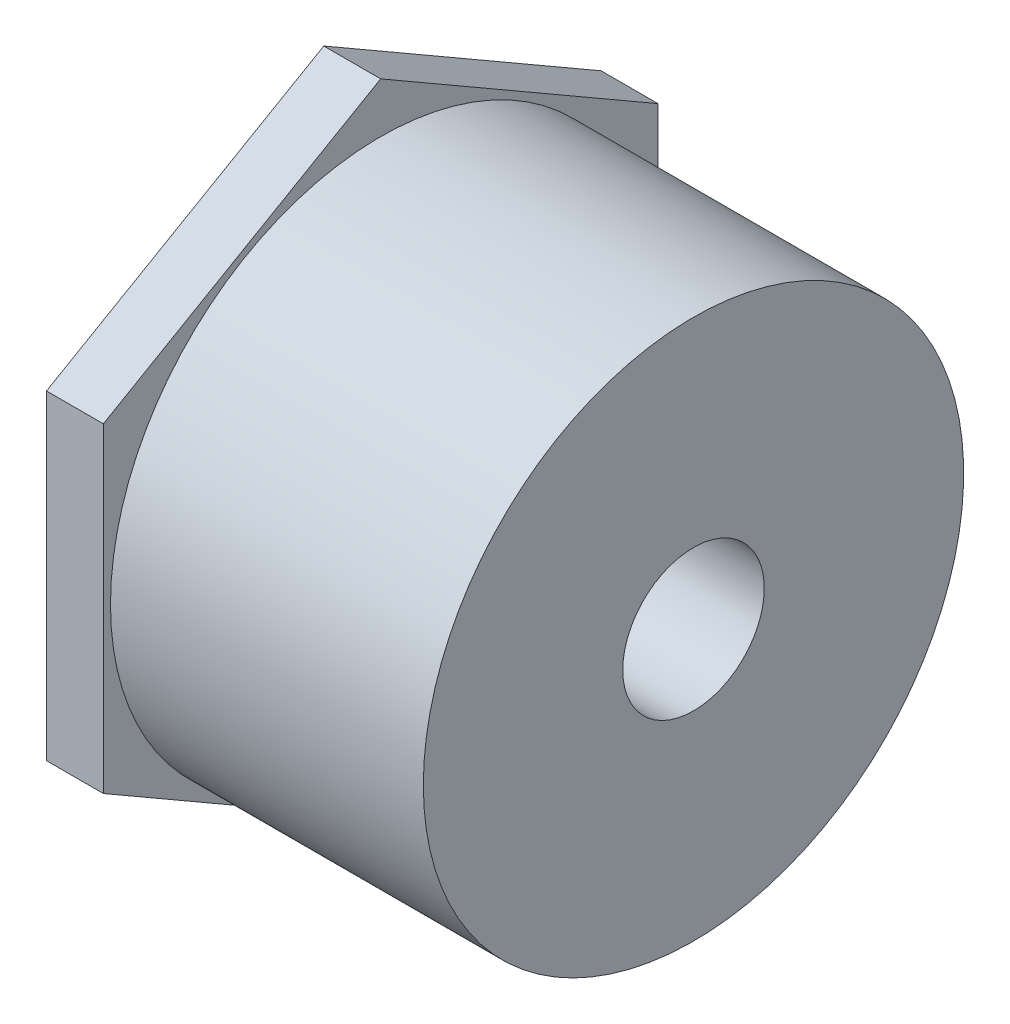
ISO-10303-21;
HEADER;
FILE_DESCRIPTION(('STEP AP214'),'2;1');
FILE_NAME('part.step','',(''),(''),'','','');
FILE_SCHEMA(('AUTOMOTIVE_DESIGN { 1 0 10303 214 1 1 1 1 }'));
ENDSEC;
DATA;
#1=APPLICATION_CONTEXT('core data for automotive mechanical design processes');
#2=APPLICATION_PROTOCOL_DEFINITION('international standard','automotive_design',2000,#1);
#3=PRODUCT_CONTEXT('',#1,'mechanical');
#4=PRODUCT('Part','Part','',(#3));
#5=PRODUCT_RELATED_PRODUCT_CATEGORY('part','',(#4));
#6=PRODUCT_DEFINITION_FORMATION('','',#4);
#7=PRODUCT_DEFINITION_CONTEXT('part definition',#1,'design');
#8=PRODUCT_DEFINITION('design','',#6,#7);
#9=PRODUCT_DEFINITION_SHAPE('','',#8);
#10=(LENGTH_UNIT() NAMED_UNIT(*) SI_UNIT(.MILLI.,.METRE.));
#11=(NAMED_UNIT(*) PLANE_ANGLE_UNIT() SI_UNIT($,.RADIAN.));
#12=(NAMED_UNIT(*) SI_UNIT($,.STERADIAN.) SOLID_ANGLE_UNIT());
#13=UNCERTAINTY_MEASURE_WITH_UNIT(LENGTH_MEASURE(1.E-05),#10,'distance_accuracy_value','');
#14=(GEOMETRIC_REPRESENTATION_CONTEXT(3) GLOBAL_UNCERTAINTY_ASSIGNED_CONTEXT((#13)) GLOBAL_UNIT_ASSIGNED_CONTEXT((#10,
#11,#12)) REPRESENTATION_CONTEXT('',''));
#15=CARTESIAN_POINT('',(0.,0.,0.));
#16=DIRECTION('',(0.,0.,1.));
#17=DIRECTION('',(1.,0.,0.));
#18=AXIS2_PLACEMENT_3D('',#15,#16,#17);
#19=CARTESIAN_POINT('',(-41.275,0.,0.));
#20=DIRECTION('',(-1.,0.,0.));
#21=DIRECTION('',(0.,0.,1.));
#22=AXIS2_PLACEMENT_3D('',#19,#20,#21);
#23=CYLINDRICAL_SURFACE('',#22,30.1625);
#24=CARTESIAN_POINT('',(0.,0.,0.));
#25=DIRECTION('',(-1.,0.,0.));
#26=DIRECTION('',(0.,0.,1.));
#27=AXIS2_PLACEMENT_3D('',#24,#25,#26);
#28=CIRCLE('',#27,30.1625);
#29=CARTESIAN_POINT('',(0.,0.,30.1625));
#30=VERTEX_POINT('',#29);
#31=EDGE_CURVE('E143',#30,#30,#28,.T.);
#32=ORIENTED_EDGE('',*,*,#31,.T.);
#33=EDGE_LOOP('',(#32));
#34=FACE_BOUND('',#33,.T.);
#35=CARTESIAN_POINT('',(-34.925,0.,0.));
#36=DIRECTION('',(-1.,0.,0.));
#37=DIRECTION('',(0.,0.,1.));
#38=AXIS2_PLACEMENT_3D('',#35,#36,#37);
#39=CIRCLE('',#38,30.1625);
#40=CARTESIAN_POINT('',(-34.925,0.,30.1625));
#41=VERTEX_POINT('',#40);
#42=EDGE_CURVE('E36',#41,#41,#39,.F.);
#43=ORIENTED_EDGE('',*,*,#42,.T.);
#44=EDGE_LOOP('',(#43));
#45=FACE_BOUND('',#44,.T.);
#46=ADVANCED_FACE('F32',(#34,#45),#23,.T.);
#47=CARTESIAN_POINT('',(-41.275,-30.1625,0.));
#48=DIRECTION('',(-1.,0.,0.));
#49=DIRECTION('',(0.,0.,1.));
#50=AXIS2_PLACEMENT_3D('',#47,#48,#49);
#51=PLANE('',#50);
#52=CARTESIAN_POINT('',(-41.275,0.,0.));
#53=DIRECTION('',(-1.,0.,0.));
#54=DIRECTION('',(0.,0.,1.));
#55=AXIS2_PLACEMENT_3D('',#52,#53,#54);
#56=CIRCLE('',#55,10.7696);
#57=CARTESIAN_POINT('',(-41.275,0.,10.7696));
#58=VERTEX_POINT('',#57);
#59=EDGE_CURVE('E11',#58,#58,#56,.T.);
#60=ORIENTED_EDGE('',*,*,#59,.F.);
#61=EDGE_LOOP('',(#60));
#62=FACE_BOUND('',#61,.T.);
#63=DIRECTION('',(0.,0.5,-0.866025403784439));
#64=VECTOR('',#63,1.);
#65=CARTESIAN_POINT('',(-41.275,17.8725992706014,30.95625));
#66=LINE('',#65,#64);
#67=CARTESIAN_POINT('',(-41.275,17.8725992706014,30.95625));
#68=VERTEX_POINT('',#67);
#69=CARTESIAN_POINT('',(-41.275,35.7451985412027,0.));
#70=VERTEX_POINT('',#69);
#71=EDGE_CURVE('E121',#68,#70,#66,.T.);
#72=ORIENTED_EDGE('',*,*,#71,.T.);
#73=DIRECTION('',(0.,-0.5,-0.866025403784439));
#74=VECTOR('',#73,1.);
#75=CARTESIAN_POINT('',(-41.275,35.7451985412027,0.));
#76=LINE('',#75,#74);
#77=CARTESIAN_POINT('',(-41.275,17.8725992706014,-30.95625));
#78=VERTEX_POINT('',#77);
#79=EDGE_CURVE('E124',#70,#78,#76,.T.);
#80=ORIENTED_EDGE('',*,*,#79,.T.);
#81=DIRECTION('',(0.,-1.,0.));
#82=VECTOR('',#81,1.);
#83=CARTESIAN_POINT('',(-41.275,17.8725992706014,-30.95625));
#84=LINE('',#83,#82);
#85=CARTESIAN_POINT('',(-41.275,-17.8725992706013,-30.95625));
#86=VERTEX_POINT('',#85);
#87=EDGE_CURVE('E127',#78,#86,#84,.T.);
#88=ORIENTED_EDGE('',*,*,#87,.T.);
#89=DIRECTION('',(0.,-0.5,0.866025403784439));
#90=VECTOR('',#89,1.);
#91=CARTESIAN_POINT('',(-41.275,-17.8725992706013,-30.95625));
#92=LINE('',#91,#90);
#93=CARTESIAN_POINT('',(-41.275,-35.7451985412027,0.));
#94=VERTEX_POINT('',#93);
#95=EDGE_CURVE('E130',#86,#94,#92,.T.);
#96=ORIENTED_EDGE('',*,*,#95,.T.);
#97=DIRECTION('',(0.,0.5,0.866025403784439));
#98=VECTOR('',#97,1.);
#99=CARTESIAN_POINT('',(-41.275,-35.7451985412027,0.));
#100=LINE('',#99,#98);
#101=CARTESIAN_POINT('',(-41.275,-17.8725992706014,30.95625));
#102=VERTEX_POINT('',#101);
#103=EDGE_CURVE('E98',#94,#102,#100,.T.);
#104=ORIENTED_EDGE('',*,*,#103,.T.);
#105=DIRECTION('',(0.,1.,0.));
#106=VECTOR('',#105,1.);
#107=CARTESIAN_POINT('',(-41.275,-17.8725992706014,30.95625));
#108=LINE('',#107,#106);
#109=EDGE_CURVE('E133',#102,#68,#108,.T.);
#110=ORIENTED_EDGE('',*,*,#109,.T.);
#111=EDGE_LOOP('',(#72,#80,#88,#96,#104,#110));
#112=FACE_BOUND('',#111,.T.);
#113=ADVANCED_FACE('F34',(#62,#112),#51,.T.);
#114=CARTESIAN_POINT('',(-22.225,0.,0.));
#115=DIRECTION('',(-1.,0.,0.));
#116=DIRECTION('',(0.,0.,1.));
#117=AXIS2_PLACEMENT_3D('',#114,#115,#116);
#118=CONICAL_SURFACE('',#117,10.6172,0.00799982933988666);
#119=ORIENTED_EDGE('',*,*,#59,.T.);
#120=EDGE_LOOP('',(#119));
#121=FACE_BOUND('',#120,.T.);
#122=CARTESIAN_POINT('',(-22.225,0.,0.));
#123=DIRECTION('',(-1.,0.,0.));
#124=DIRECTION('',(0.,0.,1.));
#125=AXIS2_PLACEMENT_3D('',#122,#123,#124);
#126=CIRCLE('',#125,10.6172);
#127=CARTESIAN_POINT('',(-22.225,0.,10.6172));
#128=VERTEX_POINT('',#127);
#129=EDGE_CURVE('E42',#128,#128,#126,.T.);
#130=ORIENTED_EDGE('',*,*,#129,.F.);
#131=EDGE_LOOP('',(#130));
#132=FACE_BOUND('',#131,.T.);
#133=ADVANCED_FACE('F158',(#121,#132),#118,.F.);
#134=CARTESIAN_POINT('',(-22.225,-7.8994,0.));
#135=DIRECTION('',(-1.,0.,0.));
#136=DIRECTION('',(0.,0.,1.));
#137=AXIS2_PLACEMENT_3D('',#134,#135,#136);
#138=PLANE('',#137);
#139=ORIENTED_EDGE('',*,*,#129,.T.);
#140=EDGE_LOOP('',(#139));
#141=FACE_BOUND('',#140,.T.);
#142=CARTESIAN_POINT('',(-22.225,0.,0.));
#143=DIRECTION('',(-1.,0.,0.));
#144=DIRECTION('',(0.,0.,1.));
#145=AXIS2_PLACEMENT_3D('',#142,#143,#144);
#146=CIRCLE('',#145,7.8994);
#147=CARTESIAN_POINT('',(-22.225,0.,7.8994));
#148=VERTEX_POINT('',#147);
#149=EDGE_CURVE('E149',#148,#148,#146,.T.);
#150=ORIENTED_EDGE('',*,*,#149,.F.);
#151=EDGE_LOOP('',(#150));
#152=FACE_BOUND('',#151,.T.);
#153=ADVANCED_FACE('F155',(#141,#152),#138,.T.);
#154=CARTESIAN_POINT('',(-41.275,0.,0.));
#155=DIRECTION('',(-1.,0.,0.));
#156=DIRECTION('',(0.,0.,1.));
#157=AXIS2_PLACEMENT_3D('',#154,#155,#156);
#158=CYLINDRICAL_SURFACE('',#157,7.8994);
#159=ORIENTED_EDGE('',*,*,#149,.T.);
#160=EDGE_LOOP('',(#159));
#161=FACE_BOUND('',#160,.T.);
#162=CARTESIAN_POINT('',(0.,0.,0.));
#163=DIRECTION('',(-1.,0.,0.));
#164=DIRECTION('',(0.,0.,1.));
#165=AXIS2_PLACEMENT_3D('',#162,#163,#164);
#166=CIRCLE('',#165,7.8994);
#167=CARTESIAN_POINT('',(0.,0.,7.8994));
#168=VERTEX_POINT('',#167);
#169=EDGE_CURVE('E146',#168,#168,#166,.T.);
#170=ORIENTED_EDGE('',*,*,#169,.F.);
#171=EDGE_LOOP('',(#170));
#172=FACE_BOUND('',#171,.T.);
#173=ADVANCED_FACE('F165',(#161,#172),#158,.F.);
#174=CARTESIAN_POINT('',(0.,-7.8994,0.));
#175=DIRECTION('',(1.,0.,0.));
#176=DIRECTION('',(0.,0.,-1.));
#177=AXIS2_PLACEMENT_3D('',#174,#175,#176);
#178=PLANE('',#177);
#179=ORIENTED_EDGE('',*,*,#169,.T.);
#180=EDGE_LOOP('',(#179));
#181=FACE_BOUND('',#180,.T.);
#182=ORIENTED_EDGE('',*,*,#31,.F.);
#183=EDGE_LOOP('',(#182));
#184=FACE_BOUND('',#183,.T.);
#185=ADVANCED_FACE('F178',(#181,#184),#178,.T.);
#186=CARTESIAN_POINT('',(-34.925,17.8725992706014,30.95625));
#187=DIRECTION('',(0.,0.866025403784439,0.5));
#188=DIRECTION('',(0.,-0.5,0.866025403784439));
#189=AXIS2_PLACEMENT_3D('',#186,#187,#188);
#190=PLANE('',#189);
#191=ORIENTED_EDGE('',*,*,#71,.F.);
#192=DIRECTION('',(-1.,0.,0.));
#193=VECTOR('',#192,1.);
#194=CARTESIAN_POINT('',(-34.925,17.8725992706014,30.95625));
#195=LINE('',#194,#193);
#196=CARTESIAN_POINT('',(-34.925,17.8725992706014,30.95625));
#197=VERTEX_POINT('',#196);
#198=EDGE_CURVE('E50',#197,#68,#195,.T.);
#199=ORIENTED_EDGE('',*,*,#198,.F.);
#200=DIRECTION('',(0.,0.5,-0.866025403784439));
#201=VECTOR('',#200,1.);
#202=CARTESIAN_POINT('',(-34.925,17.8725992706014,30.95625));
#203=LINE('',#202,#201);
#204=CARTESIAN_POINT('',(-34.925,35.7451985412027,0.));
#205=VERTEX_POINT('',#204);
#206=EDGE_CURVE('E136',#197,#205,#203,.T.);
#207=ORIENTED_EDGE('',*,*,#206,.T.);
#208=DIRECTION('',(-1.,0.,0.));
#209=VECTOR('',#208,1.);
#210=CARTESIAN_POINT('',(-34.925,35.7451985412027,0.));
#211=LINE('',#210,#209);
#212=EDGE_CURVE('E85',#205,#70,#211,.T.);
#213=ORIENTED_EDGE('',*,*,#212,.T.);
#214=EDGE_LOOP('',(#191,#199,#207,#213));
#215=FACE_BOUND('',#214,.T.);
#216=ADVANCED_FACE('F176',(#215),#190,.T.);
#217=CARTESIAN_POINT('',(-34.925,-17.8725992706014,30.95625));
#218=DIRECTION('',(0.,0.,1.));
#219=DIRECTION('',(0.,-1.,0.));
#220=AXIS2_PLACEMENT_3D('',#217,#218,#219);
#221=PLANE('',#220);
#222=ORIENTED_EDGE('',*,*,#109,.F.);
#223=DIRECTION('',(-1.,0.,0.));
#224=VECTOR('',#223,1.);
#225=CARTESIAN_POINT('',(-34.925,-17.8725992706014,30.95625));
#226=LINE('',#225,#224);
#227=CARTESIAN_POINT('',(-34.925,-17.8725992706014,30.95625));
#228=VERTEX_POINT('',#227);
#229=EDGE_CURVE('E73',#228,#102,#226,.T.);
#230=ORIENTED_EDGE('',*,*,#229,.F.);
#231=DIRECTION('',(0.,1.,0.));
#232=VECTOR('',#231,1.);
#233=CARTESIAN_POINT('',(-34.925,-17.8725992706014,30.95625));
#234=LINE('',#233,#232);
#235=EDGE_CURVE('E111',#228,#197,#234,.T.);
#236=ORIENTED_EDGE('',*,*,#235,.T.);
#237=ORIENTED_EDGE('',*,*,#198,.T.);
#238=EDGE_LOOP('',(#222,#230,#236,#237));
#239=FACE_BOUND('',#238,.T.);
#240=ADVANCED_FACE('F203',(#239),#221,.T.);
#241=CARTESIAN_POINT('',(-34.925,-35.7451985412027,0.));
#242=DIRECTION('',(0.,-0.866025403784438,0.5));
#243=DIRECTION('',(0.,-0.5,-0.866025403784439));
#244=AXIS2_PLACEMENT_3D('',#241,#242,#243);
#245=PLANE('',#244);
#246=ORIENTED_EDGE('',*,*,#103,.F.);
#247=DIRECTION('',(-1.,0.,0.));
#248=VECTOR('',#247,1.);
#249=CARTESIAN_POINT('',(-34.925,-35.7451985412027,0.));
#250=LINE('',#249,#248);
#251=CARTESIAN_POINT('',(-34.925,-35.7451985412027,0.));
#252=VERTEX_POINT('',#251);
#253=EDGE_CURVE('E93',#252,#94,#250,.T.);
#254=ORIENTED_EDGE('',*,*,#253,.F.);
#255=DIRECTION('',(0.,0.5,0.866025403784439));
#256=VECTOR('',#255,1.);
#257=CARTESIAN_POINT('',(-34.925,-35.7451985412027,0.));
#258=LINE('',#257,#256);
#259=EDGE_CURVE('E96',#252,#228,#258,.T.);
#260=ORIENTED_EDGE('',*,*,#259,.T.);
#261=ORIENTED_EDGE('',*,*,#229,.T.);
#262=EDGE_LOOP('',(#246,#254,#260,#261));
#263=FACE_BOUND('',#262,.T.);
#264=ADVANCED_FACE('F95',(#263),#245,.T.);
#265=CARTESIAN_POINT('',(-34.925,-17.8725992706013,-30.95625));
#266=DIRECTION('',(0.,-0.866025403784438,-0.5));
#267=DIRECTION('',(0.,0.5,-0.866025403784439));
#268=AXIS2_PLACEMENT_3D('',#265,#266,#267);
#269=PLANE('',#268);
#270=ORIENTED_EDGE('',*,*,#95,.F.);
#271=DIRECTION('',(-1.,0.,0.));
#272=VECTOR('',#271,1.);
#273=CARTESIAN_POINT('',(-34.925,-17.8725992706013,-30.95625));
#274=LINE('',#273,#272);
#275=CARTESIAN_POINT('',(-34.925,-17.8725992706013,-30.95625));
#276=VERTEX_POINT('',#275);
#277=EDGE_CURVE('E103',#276,#86,#274,.T.);
#278=ORIENTED_EDGE('',*,*,#277,.F.);
#279=DIRECTION('',(0.,-0.5,0.866025403784439));
#280=VECTOR('',#279,1.);
#281=CARTESIAN_POINT('',(-34.925,-17.8725992706013,-30.95625));
#282=LINE('',#281,#280);
#283=EDGE_CURVE('E109',#276,#252,#282,.T.);
#284=ORIENTED_EDGE('',*,*,#283,.T.);
#285=ORIENTED_EDGE('',*,*,#253,.T.);
#286=EDGE_LOOP('',(#270,#278,#284,#285));
#287=FACE_BOUND('',#286,.T.);
#288=ADVANCED_FACE('F113',(#287),#269,.T.);
#289=CARTESIAN_POINT('',(-34.925,17.8725992706014,-30.95625));
#290=DIRECTION('',(0.,0.,-1.));
#291=DIRECTION('',(0.,1.,0.));
#292=AXIS2_PLACEMENT_3D('',#289,#290,#291);
#293=PLANE('',#292);
#294=ORIENTED_EDGE('',*,*,#87,.F.);
#295=DIRECTION('',(-1.,0.,0.));
#296=VECTOR('',#295,1.);
#297=CARTESIAN_POINT('',(-34.925,17.8725992706014,-30.95625));
#298=LINE('',#297,#296);
#299=CARTESIAN_POINT('',(-34.925,17.8725992706014,-30.95625));
#300=VERTEX_POINT('',#299);
#301=EDGE_CURVE('E140',#300,#78,#298,.T.);
#302=ORIENTED_EDGE('',*,*,#301,.F.);
#303=DIRECTION('',(0.,-1.,0.));
#304=VECTOR('',#303,1.);
#305=CARTESIAN_POINT('',(-34.925,17.8725992706014,-30.95625));
#306=LINE('',#305,#304);
#307=EDGE_CURVE('E114',#300,#276,#306,.T.);
#308=ORIENTED_EDGE('',*,*,#307,.T.);
#309=ORIENTED_EDGE('',*,*,#277,.T.);
#310=EDGE_LOOP('',(#294,#302,#308,#309));
#311=FACE_BOUND('',#310,.T.);
#312=ADVANCED_FACE('F222',(#311),#293,.T.);
#313=CARTESIAN_POINT('',(-34.925,35.7451985412027,0.));
#314=DIRECTION('',(0.,0.866025403784439,-0.5));
#315=DIRECTION('',(0.,0.5,0.866025403784439));
#316=AXIS2_PLACEMENT_3D('',#313,#314,#315);
#317=PLANE('',#316);
#318=ORIENTED_EDGE('',*,*,#79,.F.);
#319=ORIENTED_EDGE('',*,*,#212,.F.);
#320=DIRECTION('',(0.,-0.5,-0.866025403784439));
#321=VECTOR('',#320,1.);
#322=CARTESIAN_POINT('',(-34.925,35.7451985412027,0.));
#323=LINE('',#322,#321);
#324=EDGE_CURVE('E116',#205,#300,#323,.T.);
#325=ORIENTED_EDGE('',*,*,#324,.T.);
#326=ORIENTED_EDGE('',*,*,#301,.T.);
#327=EDGE_LOOP('',(#318,#319,#325,#326));
#328=FACE_BOUND('',#327,.T.);
#329=ADVANCED_FACE('F229',(#328),#317,.T.);
#330=CARTESIAN_POINT('',(-34.925,35.7451985412027,0.));
#331=DIRECTION('',(-1.,0.,0.));
#332=DIRECTION('',(0.,0.,1.));
#333=AXIS2_PLACEMENT_3D('',#330,#331,#332);
#334=PLANE('',#333);
#335=ORIENTED_EDGE('',*,*,#42,.F.);
#336=EDGE_LOOP('',(#335));
#337=FACE_BOUND('',#336,.T.);
#338=ORIENTED_EDGE('',*,*,#206,.F.);
#339=ORIENTED_EDGE('',*,*,#235,.F.);
#340=ORIENTED_EDGE('',*,*,#259,.F.);
#341=ORIENTED_EDGE('',*,*,#283,.F.);
#342=ORIENTED_EDGE('',*,*,#307,.F.);
#343=ORIENTED_EDGE('',*,*,#324,.F.);
#344=EDGE_LOOP('',(#338,#339,#340,#341,#342,#343));
#345=FACE_BOUND('',#344,.T.);
#346=ADVANCED_FACE('F107',(#337,#345),#334,.F.);
#347=CLOSED_SHELL('',(#46,#113,#133,#153,#173,#185,#216,#240,#264,#288,#312,#329,#346));
#348=MANIFOLD_SOLID_BREP('B2',#347);
#349=ADVANCED_BREP_SHAPE_REPRESENTATION('',(#18,#348),#14);
#350=SHAPE_DEFINITION_REPRESENTATION(#9,#349);
ENDSEC;
END-ISO-10303-21;
